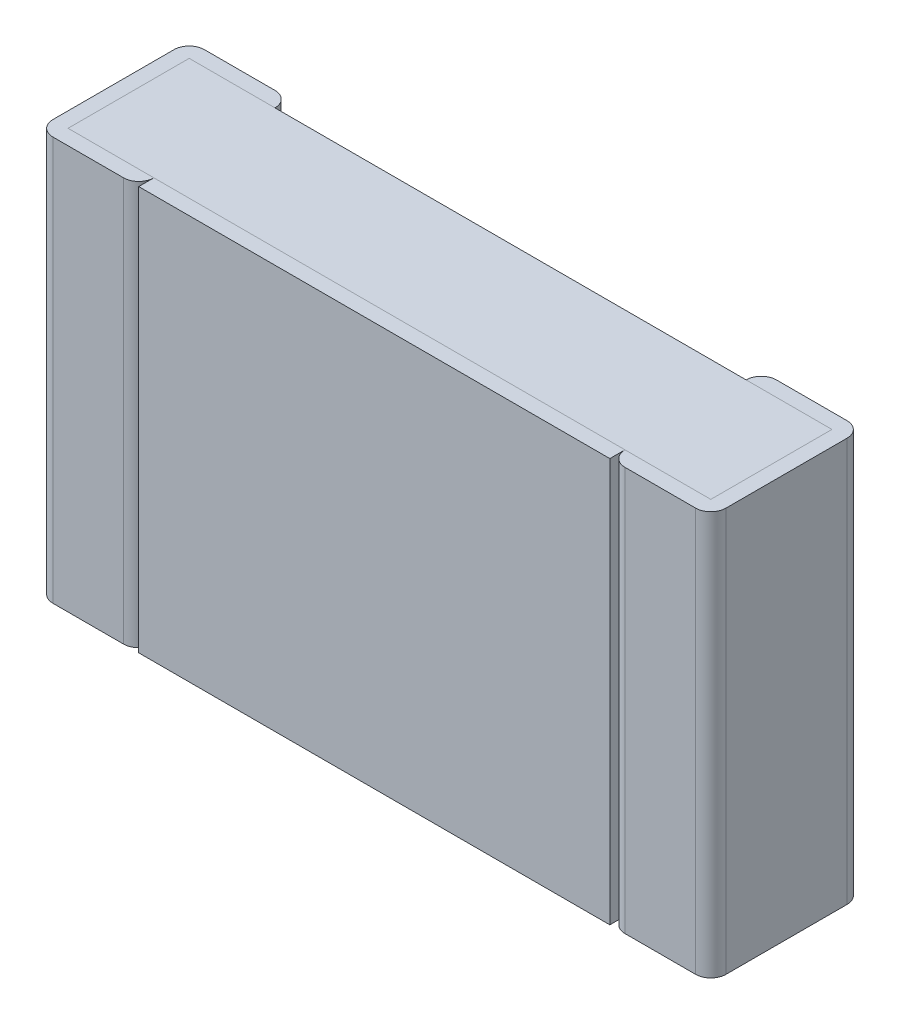
ISO-10303-21;
HEADER;
FILE_DESCRIPTION(('STEP AP214'),'2;1');
FILE_NAME('part.step','',(''),(''),'','','');
FILE_SCHEMA(('AUTOMOTIVE_DESIGN { 1 0 10303 214 1 1 1 1 }'));
ENDSEC;
DATA;
#1=APPLICATION_CONTEXT('core data for automotive mechanical design processes');
#2=APPLICATION_PROTOCOL_DEFINITION('international standard','automotive_design',2000,#1);
#3=PRODUCT_CONTEXT('',#1,'mechanical');
#4=PRODUCT('Part','Part','',(#3));
#5=PRODUCT_RELATED_PRODUCT_CATEGORY('part','',(#4));
#6=PRODUCT_DEFINITION_FORMATION('','',#4);
#7=PRODUCT_DEFINITION_CONTEXT('part definition',#1,'design');
#8=PRODUCT_DEFINITION('design','',#6,#7);
#9=PRODUCT_DEFINITION_SHAPE('','',#8);
#10=(LENGTH_UNIT() NAMED_UNIT(*) SI_UNIT(.MILLI.,.METRE.));
#11=(NAMED_UNIT(*) PLANE_ANGLE_UNIT() SI_UNIT($,.RADIAN.));
#12=(NAMED_UNIT(*) SI_UNIT($,.STERADIAN.) SOLID_ANGLE_UNIT());
#13=UNCERTAINTY_MEASURE_WITH_UNIT(LENGTH_MEASURE(1.E-05),#10,'distance_accuracy_value','');
#14=(GEOMETRIC_REPRESENTATION_CONTEXT(3) GLOBAL_UNCERTAINTY_ASSIGNED_CONTEXT((#13)) GLOBAL_UNIT_ASSIGNED_CONTEXT((#10,
#11,#12)) REPRESENTATION_CONTEXT('',''));
#15=CARTESIAN_POINT('',(0.,0.,0.));
#16=DIRECTION('',(0.,0.,1.));
#17=DIRECTION('',(1.,0.,0.));
#18=AXIS2_PLACEMENT_3D('',#15,#16,#17);
#19=CARTESIAN_POINT('',(-1.,-0.6,0.));
#20=DIRECTION('',(1.,0.,0.));
#21=DIRECTION('',(0.,1.,0.));
#22=AXIS2_PLACEMENT_3D('',#19,#20,#21);
#23=PLANE('',#22);
#24=DIRECTION('',(0.,1.,0.));
#25=VECTOR('',#24,1.);
#26=CARTESIAN_POINT('',(-1.,-0.6,0.405));
#27=LINE('',#26,#25);
#28=CARTESIAN_POINT('',(-1.,-0.6,0.405));
#29=VERTEX_POINT('',#28);
#30=CARTESIAN_POINT('',(-1.,0.6,0.405));
#31=VERTEX_POINT('',#30);
#32=EDGE_CURVE('E11',#29,#31,#27,.T.);
#33=ORIENTED_EDGE('',*,*,#32,.T.);
#34=DIRECTION('',(0.,0.,1.));
#35=VECTOR('',#34,1.);
#36=CARTESIAN_POINT('',(-1.,0.6,0.));
#37=LINE('',#36,#35);
#38=CARTESIAN_POINT('',(-1.,0.6,0.045));
#39=VERTEX_POINT('',#38);
#40=EDGE_CURVE('E41',#39,#31,#37,.T.);
#41=ORIENTED_EDGE('',*,*,#40,.F.);
#42=DIRECTION('',(0.,1.,0.));
#43=VECTOR('',#42,1.);
#44=CARTESIAN_POINT('',(-1.,-0.6,0.045));
#45=LINE('',#44,#43);
#46=CARTESIAN_POINT('',(-1.,-0.6,0.045));
#47=VERTEX_POINT('',#46);
#48=EDGE_CURVE('E215',#47,#39,#45,.T.);
#49=ORIENTED_EDGE('',*,*,#48,.F.);
#50=DIRECTION('',(0.,0.,1.));
#51=VECTOR('',#50,1.);
#52=CARTESIAN_POINT('',(-1.,-0.6,0.));
#53=LINE('',#52,#51);
#54=EDGE_CURVE('E27',#47,#29,#53,.T.);
#55=ORIENTED_EDGE('',*,*,#54,.T.);
#56=EDGE_LOOP('',(#33,#41,#49,#55));
#57=FACE_BOUND('',#56,.T.);
#58=ADVANCED_FACE('F16',(#57),#23,.F.);
#59=CARTESIAN_POINT('',(-1.,-0.6,0.));
#60=DIRECTION('',(0.,1.,0.));
#61=DIRECTION('',(1.,0.,0.));
#62=AXIS2_PLACEMENT_3D('',#59,#60,#61);
#63=PLANE('',#62);
#64=CARTESIAN_POINT('',(-0.745,-0.6,0.045));
#65=DIRECTION('',(0.,1.,0.));
#66=DIRECTION('',(0.,0.,1.));
#67=AXIS2_PLACEMENT_3D('',#64,#65,#66);
#68=CIRCLE('',#67,0.045);
#69=CARTESIAN_POINT('',(-0.7,-0.6,0.045));
#70=VERTEX_POINT('',#69);
#71=CARTESIAN_POINT('',(-0.745,-0.6,0.));
#72=VERTEX_POINT('',#71);
#73=EDGE_CURVE('E285',#70,#72,#68,.T.);
#74=ORIENTED_EDGE('',*,*,#73,.F.);
#75=DIRECTION('',(1.,0.,0.));
#76=VECTOR('',#75,1.);
#77=CARTESIAN_POINT('',(-0.955,-0.6,0.045));
#78=LINE('',#77,#76);
#79=CARTESIAN_POINT('',(-0.955,-0.6,0.045));
#80=VERTEX_POINT('',#79);
#81=EDGE_CURVE('E232',#80,#70,#78,.T.);
#82=ORIENTED_EDGE('',*,*,#81,.F.);
#83=DIRECTION('',(0.,0.,1.));
#84=VECTOR('',#83,1.);
#85=CARTESIAN_POINT('',(-0.955,-0.6,0.045));
#86=LINE('',#85,#84);
#87=CARTESIAN_POINT('',(-0.955,-0.6,0.405));
#88=VERTEX_POINT('',#87);
#89=EDGE_CURVE('E289',#80,#88,#86,.T.);
#90=ORIENTED_EDGE('',*,*,#89,.T.);
#91=DIRECTION('',(1.,0.,0.));
#92=VECTOR('',#91,1.);
#93=CARTESIAN_POINT('',(-0.955,-0.6,0.405));
#94=LINE('',#93,#92);
#95=CARTESIAN_POINT('',(-0.7,-0.6,0.405));
#96=VERTEX_POINT('',#95);
#97=EDGE_CURVE('E292',#88,#96,#94,.T.);
#98=ORIENTED_EDGE('',*,*,#97,.T.);
#99=CARTESIAN_POINT('',(-0.745,-0.6,0.405));
#100=DIRECTION('',(0.,-1.,0.));
#101=DIRECTION('',(0.,0.,1.));
#102=AXIS2_PLACEMENT_3D('',#99,#100,#101);
#103=CIRCLE('',#102,0.045);
#104=CARTESIAN_POINT('',(-0.745,-0.6,0.45));
#105=VERTEX_POINT('',#104);
#106=EDGE_CURVE('E231',#96,#105,#103,.T.);
#107=ORIENTED_EDGE('',*,*,#106,.T.);
#108=DIRECTION('',(1.,0.,0.));
#109=VECTOR('',#108,1.);
#110=CARTESIAN_POINT('',(-1.,-0.6,0.45));
#111=LINE('',#110,#109);
#112=CARTESIAN_POINT('',(-0.955,-0.6,0.45));
#113=VERTEX_POINT('',#112);
#114=EDGE_CURVE('E237',#113,#105,#111,.T.);
#115=ORIENTED_EDGE('',*,*,#114,.F.);
#116=CARTESIAN_POINT('',(-0.955,-0.6,0.405));
#117=DIRECTION('',(0.,1.,0.));
#118=DIRECTION('',(0.,0.,1.));
#119=AXIS2_PLACEMENT_3D('',#116,#117,#118);
#120=CIRCLE('',#119,0.045);
#121=EDGE_CURVE('E216',#29,#113,#120,.T.);
#122=ORIENTED_EDGE('',*,*,#121,.F.);
#123=ORIENTED_EDGE('',*,*,#54,.F.);
#124=CARTESIAN_POINT('',(-0.955,-0.6,0.045));
#125=DIRECTION('',(0.,-1.,0.));
#126=DIRECTION('',(0.,0.,1.));
#127=AXIS2_PLACEMENT_3D('',#124,#125,#126);
#128=CIRCLE('',#127,0.045);
#129=CARTESIAN_POINT('',(-0.955,-0.6,0.));
#130=VERTEX_POINT('',#129);
#131=EDGE_CURVE('E226',#47,#130,#128,.T.);
#132=ORIENTED_EDGE('',*,*,#131,.T.);
#133=DIRECTION('',(1.,0.,0.));
#134=VECTOR('',#133,1.);
#135=CARTESIAN_POINT('',(-1.,-0.6,0.));
#136=LINE('',#135,#134);
#137=EDGE_CURVE('E223',#130,#72,#136,.T.);
#138=ORIENTED_EDGE('',*,*,#137,.T.);
#139=EDGE_LOOP('',(#74,#82,#90,#98,#107,#115,#122,#123,#132,#138));
#140=FACE_BOUND('',#139,.T.);
#141=ADVANCED_FACE('F447',(#140),#63,.F.);
#142=CARTESIAN_POINT('',(-0.955,-0.6,0.045));
#143=DIRECTION('',(0.,1.,0.));
#144=DIRECTION('',(-1.,0.,0.));
#145=AXIS2_PLACEMENT_3D('',#142,#143,#144);
#146=CYLINDRICAL_SURFACE('',#145,0.045);
#147=ORIENTED_EDGE('',*,*,#48,.T.);
#148=CARTESIAN_POINT('',(-0.955,0.6,0.045));
#149=DIRECTION('',(0.,-1.,0.));
#150=DIRECTION('',(0.,0.,1.));
#151=AXIS2_PLACEMENT_3D('',#148,#149,#150);
#152=CIRCLE('',#151,0.045);
#153=CARTESIAN_POINT('',(-0.955,0.6,0.));
#154=VERTEX_POINT('',#153);
#155=EDGE_CURVE('E212',#39,#154,#152,.T.);
#156=ORIENTED_EDGE('',*,*,#155,.T.);
#157=DIRECTION('',(0.,1.,0.));
#158=VECTOR('',#157,1.);
#159=CARTESIAN_POINT('',(-0.955,-0.6,0.));
#160=LINE('',#159,#158);
#161=EDGE_CURVE('E207',#130,#154,#160,.T.);
#162=ORIENTED_EDGE('',*,*,#161,.F.);
#163=ORIENTED_EDGE('',*,*,#131,.F.);
#164=EDGE_LOOP('',(#147,#156,#162,#163));
#165=FACE_BOUND('',#164,.T.);
#166=ADVANCED_FACE('F455',(#165),#146,.T.);
#167=CARTESIAN_POINT('',(-0.955,-0.6,0.405));
#168=DIRECTION('',(0.,1.,0.));
#169=DIRECTION('',(-1.,0.,0.));
#170=AXIS2_PLACEMENT_3D('',#167,#168,#169);
#171=CYLINDRICAL_SURFACE('',#170,0.045);
#172=ORIENTED_EDGE('',*,*,#121,.T.);
#173=DIRECTION('',(0.,1.,0.));
#174=VECTOR('',#173,1.);
#175=CARTESIAN_POINT('',(-0.955,-0.6,0.45));
#176=LINE('',#175,#174);
#177=CARTESIAN_POINT('',(-0.955,0.6,0.45));
#178=VERTEX_POINT('',#177);
#179=EDGE_CURVE('E293',#113,#178,#176,.T.);
#180=ORIENTED_EDGE('',*,*,#179,.T.);
#181=CARTESIAN_POINT('',(-0.955,0.6,0.405));
#182=DIRECTION('',(0.,1.,0.));
#183=DIRECTION('',(0.,0.,1.));
#184=AXIS2_PLACEMENT_3D('',#181,#182,#183);
#185=CIRCLE('',#184,0.045);
#186=EDGE_CURVE('E204',#31,#178,#185,.T.);
#187=ORIENTED_EDGE('',*,*,#186,.F.);
#188=ORIENTED_EDGE('',*,*,#32,.F.);
#189=EDGE_LOOP('',(#172,#180,#187,#188));
#190=FACE_BOUND('',#189,.T.);
#191=ADVANCED_FACE('F525',(#190),#171,.T.);
#192=CARTESIAN_POINT('',(-1.,0.6,0.));
#193=DIRECTION('',(0.,1.,0.));
#194=DIRECTION('',(1.,0.,0.));
#195=AXIS2_PLACEMENT_3D('',#192,#193,#194);
#196=PLANE('',#195);
#197=DIRECTION('',(1.,0.,0.));
#198=VECTOR('',#197,1.);
#199=CARTESIAN_POINT('',(-1.,0.6,0.));
#200=LINE('',#199,#198);
#201=CARTESIAN_POINT('',(-0.745,0.6,0.));
#202=VERTEX_POINT('',#201);
#203=EDGE_CURVE('E317',#154,#202,#200,.T.);
#204=ORIENTED_EDGE('',*,*,#203,.F.);
#205=ORIENTED_EDGE('',*,*,#155,.F.);
#206=ORIENTED_EDGE('',*,*,#40,.T.);
#207=ORIENTED_EDGE('',*,*,#186,.T.);
#208=DIRECTION('',(1.,0.,0.));
#209=VECTOR('',#208,1.);
#210=CARTESIAN_POINT('',(-1.,0.6,0.45));
#211=LINE('',#210,#209);
#212=CARTESIAN_POINT('',(-0.745,0.6,0.45));
#213=VERTEX_POINT('',#212);
#214=EDGE_CURVE('E196',#178,#213,#211,.T.);
#215=ORIENTED_EDGE('',*,*,#214,.T.);
#216=CARTESIAN_POINT('',(-0.745,0.6,0.405));
#217=DIRECTION('',(0.,-1.,0.));
#218=DIRECTION('',(0.,0.,1.));
#219=AXIS2_PLACEMENT_3D('',#216,#217,#218);
#220=CIRCLE('',#219,0.045);
#221=CARTESIAN_POINT('',(-0.7,0.6,0.405));
#222=VERTEX_POINT('',#221);
#223=EDGE_CURVE('E189',#222,#213,#220,.T.);
#224=ORIENTED_EDGE('',*,*,#223,.F.);
#225=DIRECTION('',(1.,0.,0.));
#226=VECTOR('',#225,1.);
#227=CARTESIAN_POINT('',(-0.955,0.6,0.405));
#228=LINE('',#227,#226);
#229=CARTESIAN_POINT('',(-0.955,0.6,0.405));
#230=VERTEX_POINT('',#229);
#231=EDGE_CURVE('E186',#230,#222,#228,.T.);
#232=ORIENTED_EDGE('',*,*,#231,.F.);
#233=DIRECTION('',(0.,0.,1.));
#234=VECTOR('',#233,1.);
#235=CARTESIAN_POINT('',(-0.955,0.6,0.045));
#236=LINE('',#235,#234);
#237=CARTESIAN_POINT('',(-0.955,0.6,0.045));
#238=VERTEX_POINT('',#237);
#239=EDGE_CURVE('E177',#238,#230,#236,.T.);
#240=ORIENTED_EDGE('',*,*,#239,.F.);
#241=DIRECTION('',(1.,0.,0.));
#242=VECTOR('',#241,1.);
#243=CARTESIAN_POINT('',(-0.955,0.6,0.045));
#244=LINE('',#243,#242);
#245=CARTESIAN_POINT('',(-0.7,0.6,0.045));
#246=VERTEX_POINT('',#245);
#247=EDGE_CURVE('E182',#238,#246,#244,.T.);
#248=ORIENTED_EDGE('',*,*,#247,.T.);
#249=CARTESIAN_POINT('',(-0.745,0.6,0.045));
#250=DIRECTION('',(0.,1.,0.));
#251=DIRECTION('',(0.,0.,1.));
#252=AXIS2_PLACEMENT_3D('',#249,#250,#251);
#253=CIRCLE('',#252,0.045);
#254=EDGE_CURVE('E197',#246,#202,#253,.T.);
#255=ORIENTED_EDGE('',*,*,#254,.T.);
#256=EDGE_LOOP('',(#204,#205,#206,#207,#215,#224,#232,#240,#248,#255));
#257=FACE_BOUND('',#256,.T.);
#258=ADVANCED_FACE('F180',(#257),#196,.T.);
#259=CARTESIAN_POINT('',(-1.,-0.6,0.));
#260=DIRECTION('',(0.,0.,1.));
#261=DIRECTION('',(1.,0.,0.));
#262=AXIS2_PLACEMENT_3D('',#259,#260,#261);
#263=PLANE('',#262);
#264=DIRECTION('',(0.,1.,0.));
#265=VECTOR('',#264,1.);
#266=CARTESIAN_POINT('',(-0.745,-0.6,0.));
#267=LINE('',#266,#265);
#268=EDGE_CURVE('E281',#72,#202,#267,.T.);
#269=ORIENTED_EDGE('',*,*,#268,.F.);
#270=ORIENTED_EDGE('',*,*,#137,.F.);
#271=ORIENTED_EDGE('',*,*,#161,.T.);
#272=ORIENTED_EDGE('',*,*,#203,.T.);
#273=EDGE_LOOP('',(#269,#270,#271,#272));
#274=FACE_BOUND('',#273,.T.);
#275=ADVANCED_FACE('F452',(#274),#263,.F.);
#276=CARTESIAN_POINT('',(-0.745,-0.6,0.045));
#277=DIRECTION('',(0.,1.,0.));
#278=DIRECTION('',(1.,0.,0.));
#279=AXIS2_PLACEMENT_3D('',#276,#277,#278);
#280=CYLINDRICAL_SURFACE('',#279,0.045);
#281=ORIENTED_EDGE('',*,*,#73,.T.);
#282=ORIENTED_EDGE('',*,*,#268,.T.);
#283=ORIENTED_EDGE('',*,*,#254,.F.);
#284=DIRECTION('',(0.,1.,0.));
#285=VECTOR('',#284,1.);
#286=CARTESIAN_POINT('',(-0.7,-0.6,0.045));
#287=LINE('',#286,#285);
#288=EDGE_CURVE('E241',#70,#246,#287,.T.);
#289=ORIENTED_EDGE('',*,*,#288,.F.);
#290=EDGE_LOOP('',(#281,#282,#283,#289));
#291=FACE_BOUND('',#290,.T.);
#292=ADVANCED_FACE('F440',(#291),#280,.T.);
#293=CARTESIAN_POINT('',(-0.955,-0.6,0.045));
#294=DIRECTION('',(0.,1.,0.));
#295=DIRECTION('',(1.,0.,0.));
#296=AXIS2_PLACEMENT_3D('',#293,#294,#295);
#297=PLANE('',#296);
#298=DIRECTION('',(1.,0.,0.));
#299=VECTOR('',#298,1.);
#300=CARTESIAN_POINT('',(-0.955,-0.6,0.045));
#301=LINE('',#300,#299);
#302=CARTESIAN_POINT('',(0.7,-0.6,0.045));
#303=VERTEX_POINT('',#302);
#304=EDGE_CURVE('E248',#70,#303,#301,.T.);
#305=ORIENTED_EDGE('',*,*,#304,.T.);
#306=DIRECTION('',(1.,0.,0.));
#307=VECTOR('',#306,1.);
#308=CARTESIAN_POINT('',(-0.955,-0.6,0.045));
#309=LINE('',#308,#307);
#310=CARTESIAN_POINT('',(0.955,-0.6,0.045));
#311=VERTEX_POINT('',#310);
#312=EDGE_CURVE('E245',#303,#311,#309,.T.);
#313=ORIENTED_EDGE('',*,*,#312,.T.);
#314=DIRECTION('',(0.,0.,1.));
#315=VECTOR('',#314,1.);
#316=CARTESIAN_POINT('',(0.955,-0.6,0.045));
#317=LINE('',#316,#315);
#318=CARTESIAN_POINT('',(0.955,-0.6,0.405));
#319=VERTEX_POINT('',#318);
#320=EDGE_CURVE('E236',#311,#319,#317,.T.);
#321=ORIENTED_EDGE('',*,*,#320,.T.);
#322=DIRECTION('',(1.,0.,0.));
#323=VECTOR('',#322,1.);
#324=CARTESIAN_POINT('',(-0.955,-0.6,0.405));
#325=LINE('',#324,#323);
#326=CARTESIAN_POINT('',(0.7,-0.6,0.405));
#327=VERTEX_POINT('',#326);
#328=EDGE_CURVE('E221',#327,#319,#325,.T.);
#329=ORIENTED_EDGE('',*,*,#328,.F.);
#330=DIRECTION('',(1.,0.,0.));
#331=VECTOR('',#330,1.);
#332=CARTESIAN_POINT('',(-0.7,-0.6,0.405));
#333=LINE('',#332,#331);
#334=EDGE_CURVE('E360',#96,#327,#333,.T.);
#335=ORIENTED_EDGE('',*,*,#334,.F.);
#336=ORIENTED_EDGE('',*,*,#97,.F.);
#337=ORIENTED_EDGE('',*,*,#89,.F.);
#338=ORIENTED_EDGE('',*,*,#81,.T.);
#339=EDGE_LOOP('',(#305,#313,#321,#329,#335,#336,#337,#338));
#340=FACE_BOUND('',#339,.T.);
#341=ADVANCED_FACE('F509',(#340),#297,.F.);
#342=CARTESIAN_POINT('',(-1.,-0.6,0.45));
#343=DIRECTION('',(0.,0.,1.));
#344=DIRECTION('',(1.,0.,0.));
#345=AXIS2_PLACEMENT_3D('',#342,#343,#344);
#346=PLANE('',#345);
#347=ORIENTED_EDGE('',*,*,#214,.F.);
#348=ORIENTED_EDGE('',*,*,#179,.F.);
#349=ORIENTED_EDGE('',*,*,#114,.T.);
#350=DIRECTION('',(0.,1.,0.));
#351=VECTOR('',#350,1.);
#352=CARTESIAN_POINT('',(-0.745,-0.6,0.45));
#353=LINE('',#352,#351);
#354=EDGE_CURVE('E280',#105,#213,#353,.T.);
#355=ORIENTED_EDGE('',*,*,#354,.T.);
#356=EDGE_LOOP('',(#347,#348,#349,#355));
#357=FACE_BOUND('',#356,.T.);
#358=ADVANCED_FACE('F528',(#357),#346,.T.);
#359=CARTESIAN_POINT('',(-0.745,-0.6,0.405));
#360=DIRECTION('',(0.,1.,0.));
#361=DIRECTION('',(1.,0.,0.));
#362=AXIS2_PLACEMENT_3D('',#359,#360,#361);
#363=CYLINDRICAL_SURFACE('',#362,0.045);
#364=DIRECTION('',(0.,1.,0.));
#365=VECTOR('',#364,1.);
#366=CARTESIAN_POINT('',(-0.7,-0.6,0.405));
#367=LINE('',#366,#365);
#368=EDGE_CURVE('E299',#96,#222,#367,.T.);
#369=ORIENTED_EDGE('',*,*,#368,.T.);
#370=ORIENTED_EDGE('',*,*,#223,.T.);
#371=ORIENTED_EDGE('',*,*,#354,.F.);
#372=ORIENTED_EDGE('',*,*,#106,.F.);
#373=EDGE_LOOP('',(#369,#370,#371,#372));
#374=FACE_BOUND('',#373,.T.);
#375=ADVANCED_FACE('F519',(#374),#363,.T.);
#376=CARTESIAN_POINT('',(-0.955,0.6,0.045));
#377=DIRECTION('',(0.,1.,0.));
#378=DIRECTION('',(1.,0.,0.));
#379=AXIS2_PLACEMENT_3D('',#376,#377,#378);
#380=PLANE('',#379);
#381=ORIENTED_EDGE('',*,*,#247,.F.);
#382=ORIENTED_EDGE('',*,*,#239,.T.);
#383=ORIENTED_EDGE('',*,*,#231,.T.);
#384=DIRECTION('',(1.,0.,0.));
#385=VECTOR('',#384,1.);
#386=CARTESIAN_POINT('',(-0.7,0.6,0.405));
#387=LINE('',#386,#385);
#388=CARTESIAN_POINT('',(0.7,0.6,0.405));
#389=VERTEX_POINT('',#388);
#390=EDGE_CURVE('E244',#222,#389,#387,.T.);
#391=ORIENTED_EDGE('',*,*,#390,.T.);
#392=DIRECTION('',(1.,0.,0.));
#393=VECTOR('',#392,1.);
#394=CARTESIAN_POINT('',(-0.955,0.6,0.405));
#395=LINE('',#394,#393);
#396=CARTESIAN_POINT('',(0.955,0.6,0.405));
#397=VERTEX_POINT('',#396);
#398=EDGE_CURVE('E240',#389,#397,#395,.T.);
#399=ORIENTED_EDGE('',*,*,#398,.T.);
#400=DIRECTION('',(0.,0.,1.));
#401=VECTOR('',#400,1.);
#402=CARTESIAN_POINT('',(0.955,0.6,0.045));
#403=LINE('',#402,#401);
#404=CARTESIAN_POINT('',(0.955,0.6,0.045));
#405=VERTEX_POINT('',#404);
#406=EDGE_CURVE('E253',#405,#397,#403,.T.);
#407=ORIENTED_EDGE('',*,*,#406,.F.);
#408=DIRECTION('',(1.,0.,0.));
#409=VECTOR('',#408,1.);
#410=CARTESIAN_POINT('',(-0.955,0.6,0.045));
#411=LINE('',#410,#409);
#412=CARTESIAN_POINT('',(0.7,0.6,0.045));
#413=VERTEX_POINT('',#412);
#414=EDGE_CURVE('E262',#413,#405,#411,.T.);
#415=ORIENTED_EDGE('',*,*,#414,.F.);
#416=DIRECTION('',(1.,0.,0.));
#417=VECTOR('',#416,1.);
#418=CARTESIAN_POINT('',(-0.955,0.6,0.045));
#419=LINE('',#418,#417);
#420=EDGE_CURVE('E194',#246,#413,#419,.T.);
#421=ORIENTED_EDGE('',*,*,#420,.F.);
#422=EDGE_LOOP('',(#381,#382,#383,#391,#399,#407,#415,#421));
#423=FACE_BOUND('',#422,.T.);
#424=ADVANCED_FACE('F191',(#423),#380,.T.);
#425=CARTESIAN_POINT('',(-0.955,-0.6,0.045));
#426=DIRECTION('',(0.,0.,1.));
#427=DIRECTION('',(1.,0.,0.));
#428=AXIS2_PLACEMENT_3D('',#425,#426,#427);
#429=PLANE('',#428);
#430=ORIENTED_EDGE('',*,*,#420,.T.);
#431=DIRECTION('',(0.,1.,0.));
#432=VECTOR('',#431,1.);
#433=CARTESIAN_POINT('',(0.7,-0.6,0.045));
#434=LINE('',#433,#432);
#435=EDGE_CURVE('E304',#303,#413,#434,.T.);
#436=ORIENTED_EDGE('',*,*,#435,.F.);
#437=ORIENTED_EDGE('',*,*,#304,.F.);
#438=ORIENTED_EDGE('',*,*,#288,.T.);
#439=EDGE_LOOP('',(#430,#436,#437,#438));
#440=FACE_BOUND('',#439,.T.);
#441=ADVANCED_FACE('F18',(#440),#429,.F.);
#442=CARTESIAN_POINT('',(0.7,-0.6,0.));
#443=DIRECTION('',(0.,1.,0.));
#444=DIRECTION('',(1.,0.,0.));
#445=AXIS2_PLACEMENT_3D('',#442,#443,#444);
#446=PLANE('',#445);
#447=CARTESIAN_POINT('',(0.955,-0.6,0.045));
#448=DIRECTION('',(0.,1.,0.));
#449=DIRECTION('',(0.,0.,1.));
#450=AXIS2_PLACEMENT_3D('',#447,#448,#449);
#451=CIRCLE('',#450,0.045);
#452=CARTESIAN_POINT('',(1.,-0.6,0.045));
#453=VERTEX_POINT('',#452);
#454=CARTESIAN_POINT('',(0.955,-0.6,0.));
#455=VERTEX_POINT('',#454);
#456=EDGE_CURVE('E347',#453,#455,#451,.T.);
#457=ORIENTED_EDGE('',*,*,#456,.F.);
#458=DIRECTION('',(0.,0.,1.));
#459=VECTOR('',#458,1.);
#460=CARTESIAN_POINT('',(1.,-0.6,0.));
#461=LINE('',#460,#459);
#462=CARTESIAN_POINT('',(1.,-0.6,0.405));
#463=VERTEX_POINT('',#462);
#464=EDGE_CURVE('E339',#453,#463,#461,.T.);
#465=ORIENTED_EDGE('',*,*,#464,.T.);
#466=CARTESIAN_POINT('',(0.955,-0.6,0.405));
#467=DIRECTION('',(0.,-1.,0.));
#468=DIRECTION('',(0.,0.,1.));
#469=AXIS2_PLACEMENT_3D('',#466,#467,#468);
#470=CIRCLE('',#469,0.045);
#471=CARTESIAN_POINT('',(0.955,-0.6,0.45));
#472=VERTEX_POINT('',#471);
#473=EDGE_CURVE('E340',#463,#472,#470,.T.);
#474=ORIENTED_EDGE('',*,*,#473,.T.);
#475=DIRECTION('',(1.,0.,0.));
#476=VECTOR('',#475,1.);
#477=CARTESIAN_POINT('',(0.7,-0.6,0.45));
#478=LINE('',#477,#476);
#479=CARTESIAN_POINT('',(0.745,-0.6,0.45));
#480=VERTEX_POINT('',#479);
#481=EDGE_CURVE('E318',#480,#472,#478,.T.);
#482=ORIENTED_EDGE('',*,*,#481,.F.);
#483=CARTESIAN_POINT('',(0.745,-0.6,0.405));
#484=DIRECTION('',(0.,1.,0.));
#485=DIRECTION('',(0.,0.,1.));
#486=AXIS2_PLACEMENT_3D('',#483,#484,#485);
#487=CIRCLE('',#486,0.045);
#488=EDGE_CURVE('E366',#327,#480,#487,.T.);
#489=ORIENTED_EDGE('',*,*,#488,.F.);
#490=ORIENTED_EDGE('',*,*,#328,.T.);
#491=ORIENTED_EDGE('',*,*,#320,.F.);
#492=ORIENTED_EDGE('',*,*,#312,.F.);
#493=CARTESIAN_POINT('',(0.745,-0.6,0.045));
#494=DIRECTION('',(0.,-1.,0.));
#495=DIRECTION('',(0.,0.,1.));
#496=AXIS2_PLACEMENT_3D('',#493,#494,#495);
#497=CIRCLE('',#496,0.045);
#498=CARTESIAN_POINT('',(0.745,-0.6,0.));
#499=VERTEX_POINT('',#498);
#500=EDGE_CURVE('E217',#303,#499,#497,.T.);
#501=ORIENTED_EDGE('',*,*,#500,.T.);
#502=DIRECTION('',(1.,0.,0.));
#503=VECTOR('',#502,1.);
#504=CARTESIAN_POINT('',(0.7,-0.6,0.));
#505=LINE('',#504,#503);
#506=EDGE_CURVE('E222',#499,#455,#505,.T.);
#507=ORIENTED_EDGE('',*,*,#506,.T.);
#508=EDGE_LOOP('',(#457,#465,#474,#482,#489,#490,#491,#492,#501,#507));
#509=FACE_BOUND('',#508,.T.);
#510=ADVANCED_FACE('F506',(#509),#446,.F.);
#511=CARTESIAN_POINT('',(-0.7,-0.6,0.405));
#512=DIRECTION('',(0.,1.,0.));
#513=DIRECTION('',(1.,0.,0.));
#514=AXIS2_PLACEMENT_3D('',#511,#512,#513);
#515=PLANE('',#514);
#516=DIRECTION('',(0.,0.,1.));
#517=VECTOR('',#516,1.);
#518=CARTESIAN_POINT('',(0.7,-0.6,0.405));
#519=LINE('',#518,#517);
#520=CARTESIAN_POINT('',(0.7,-0.6,0.45));
#521=VERTEX_POINT('',#520);
#522=EDGE_CURVE('E329',#327,#521,#519,.T.);
#523=ORIENTED_EDGE('',*,*,#522,.T.);
#524=DIRECTION('',(1.,0.,0.));
#525=VECTOR('',#524,1.);
#526=CARTESIAN_POINT('',(-0.7,-0.6,0.45));
#527=LINE('',#526,#525);
#528=CARTESIAN_POINT('',(-0.7,-0.6,0.45));
#529=VERTEX_POINT('',#528);
#530=EDGE_CURVE('E267',#529,#521,#527,.T.);
#531=ORIENTED_EDGE('',*,*,#530,.F.);
#532=DIRECTION('',(0.,0.,1.));
#533=VECTOR('',#532,1.);
#534=CARTESIAN_POINT('',(-0.7,-0.6,0.405));
#535=LINE('',#534,#533);
#536=EDGE_CURVE('E271',#96,#529,#535,.T.);
#537=ORIENTED_EDGE('',*,*,#536,.F.);
#538=ORIENTED_EDGE('',*,*,#334,.T.);
#539=EDGE_LOOP('',(#523,#531,#537,#538));
#540=FACE_BOUND('',#539,.T.);
#541=ADVANCED_FACE('F408',(#540),#515,.F.);
#542=CARTESIAN_POINT('',(-0.7,-0.6,0.405));
#543=DIRECTION('',(1.,0.,0.));
#544=DIRECTION('',(0.,1.,0.));
#545=AXIS2_PLACEMENT_3D('',#542,#543,#544);
#546=PLANE('',#545);
#547=DIRECTION('',(0.,1.,0.));
#548=VECTOR('',#547,1.);
#549=CARTESIAN_POINT('',(-0.7,-0.6,0.45));
#550=LINE('',#549,#548);
#551=CARTESIAN_POINT('',(-0.7,0.6,0.45));
#552=VERTEX_POINT('',#551);
#553=EDGE_CURVE('E312',#529,#552,#550,.T.);
#554=ORIENTED_EDGE('',*,*,#553,.T.);
#555=DIRECTION('',(0.,0.,1.));
#556=VECTOR('',#555,1.);
#557=CARTESIAN_POINT('',(-0.7,0.6,0.405));
#558=LINE('',#557,#556);
#559=EDGE_CURVE('E255',#222,#552,#558,.T.);
#560=ORIENTED_EDGE('',*,*,#559,.F.);
#561=ORIENTED_EDGE('',*,*,#368,.F.);
#562=ORIENTED_EDGE('',*,*,#536,.T.);
#563=EDGE_LOOP('',(#554,#560,#561,#562));
#564=FACE_BOUND('',#563,.T.);
#565=ADVANCED_FACE('F516',(#564),#546,.F.);
#566=CARTESIAN_POINT('',(0.7,0.6,0.));
#567=DIRECTION('',(0.,1.,0.));
#568=DIRECTION('',(1.,0.,0.));
#569=AXIS2_PLACEMENT_3D('',#566,#567,#568);
#570=PLANE('',#569);
#571=DIRECTION('',(1.,0.,0.));
#572=VECTOR('',#571,1.);
#573=CARTESIAN_POINT('',(0.7,0.6,0.));
#574=LINE('',#573,#572);
#575=CARTESIAN_POINT('',(0.745,0.6,0.));
#576=VERTEX_POINT('',#575);
#577=CARTESIAN_POINT('',(0.955,0.6,0.));
#578=VERTEX_POINT('',#577);
#579=EDGE_CURVE('E336',#576,#578,#574,.T.);
#580=ORIENTED_EDGE('',*,*,#579,.F.);
#581=CARTESIAN_POINT('',(0.745,0.6,0.045));
#582=DIRECTION('',(0.,-1.,0.));
#583=DIRECTION('',(0.,0.,1.));
#584=AXIS2_PLACEMENT_3D('',#581,#582,#583);
#585=CIRCLE('',#584,0.045);
#586=EDGE_CURVE('E300',#413,#576,#585,.T.);
#587=ORIENTED_EDGE('',*,*,#586,.F.);
#588=ORIENTED_EDGE('',*,*,#414,.T.);
#589=ORIENTED_EDGE('',*,*,#406,.T.);
#590=ORIENTED_EDGE('',*,*,#398,.F.);
#591=CARTESIAN_POINT('',(0.745,0.6,0.405));
#592=DIRECTION('',(0.,1.,0.));
#593=DIRECTION('',(0.,0.,1.));
#594=AXIS2_PLACEMENT_3D('',#591,#592,#593);
#595=CIRCLE('',#594,0.045);
#596=CARTESIAN_POINT('',(0.745,0.6,0.45));
#597=VERTEX_POINT('',#596);
#598=EDGE_CURVE('E249',#389,#597,#595,.T.);
#599=ORIENTED_EDGE('',*,*,#598,.T.);
#600=DIRECTION('',(1.,0.,0.));
#601=VECTOR('',#600,1.);
#602=CARTESIAN_POINT('',(0.7,0.6,0.45));
#603=LINE('',#602,#601);
#604=CARTESIAN_POINT('',(0.955,0.6,0.45));
#605=VERTEX_POINT('',#604);
#606=EDGE_CURVE('E254',#597,#605,#603,.T.);
#607=ORIENTED_EDGE('',*,*,#606,.T.);
#608=CARTESIAN_POINT('',(0.955,0.6,0.405));
#609=DIRECTION('',(0.,-1.,0.));
#610=DIRECTION('',(0.,0.,1.));
#611=AXIS2_PLACEMENT_3D('',#608,#609,#610);
#612=CIRCLE('',#611,0.045);
#613=CARTESIAN_POINT('',(1.,0.6,0.405));
#614=VERTEX_POINT('',#613);
#615=EDGE_CURVE('E322',#614,#605,#612,.T.);
#616=ORIENTED_EDGE('',*,*,#615,.F.);
#617=DIRECTION('',(0.,0.,1.));
#618=VECTOR('',#617,1.);
#619=CARTESIAN_POINT('',(1.,0.6,0.));
#620=LINE('',#619,#618);
#621=CARTESIAN_POINT('',(1.,0.6,0.045));
#622=VERTEX_POINT('',#621);
#623=EDGE_CURVE('E380',#622,#614,#620,.T.);
#624=ORIENTED_EDGE('',*,*,#623,.F.);
#625=CARTESIAN_POINT('',(0.955,0.6,0.045));
#626=DIRECTION('',(0.,1.,0.));
#627=DIRECTION('',(0.,0.,1.));
#628=AXIS2_PLACEMENT_3D('',#625,#626,#627);
#629=CIRCLE('',#628,0.045);
#630=EDGE_CURVE('E20',#622,#578,#629,.T.);
#631=ORIENTED_EDGE('',*,*,#630,.T.);
#632=EDGE_LOOP('',(#580,#587,#588,#589,#590,#599,#607,#616,#624,#631));
#633=FACE_BOUND('',#632,.T.);
#634=ADVANCED_FACE('F492',(#633),#570,.T.);
#635=CARTESIAN_POINT('',(-0.7,0.6,0.405));
#636=DIRECTION('',(0.,1.,0.));
#637=DIRECTION('',(1.,0.,0.));
#638=AXIS2_PLACEMENT_3D('',#635,#636,#637);
#639=PLANE('',#638);
#640=ORIENTED_EDGE('',*,*,#390,.F.);
#641=ORIENTED_EDGE('',*,*,#559,.T.);
#642=DIRECTION('',(1.,0.,0.));
#643=VECTOR('',#642,1.);
#644=CARTESIAN_POINT('',(-0.7,0.6,0.45));
#645=LINE('',#644,#643);
#646=CARTESIAN_POINT('',(0.7,0.6,0.45));
#647=VERTEX_POINT('',#646);
#648=EDGE_CURVE('E258',#552,#647,#645,.T.);
#649=ORIENTED_EDGE('',*,*,#648,.T.);
#650=DIRECTION('',(0.,0.,1.));
#651=VECTOR('',#650,1.);
#652=CARTESIAN_POINT('',(0.7,0.6,0.405));
#653=LINE('',#652,#651);
#654=EDGE_CURVE('E277',#389,#647,#653,.T.);
#655=ORIENTED_EDGE('',*,*,#654,.F.);
#656=EDGE_LOOP('',(#640,#641,#649,#655));
#657=FACE_BOUND('',#656,.T.);
#658=ADVANCED_FACE('F572',(#657),#639,.T.);
#659=CARTESIAN_POINT('',(0.745,-0.6,0.045));
#660=DIRECTION('',(0.,1.,0.));
#661=DIRECTION('',(-1.,0.,0.));
#662=AXIS2_PLACEMENT_3D('',#659,#660,#661);
#663=CYLINDRICAL_SURFACE('',#662,0.045);
#664=ORIENTED_EDGE('',*,*,#435,.T.);
#665=ORIENTED_EDGE('',*,*,#586,.T.);
#666=DIRECTION('',(0.,1.,0.));
#667=VECTOR('',#666,1.);
#668=CARTESIAN_POINT('',(0.745,-0.6,0.));
#669=LINE('',#668,#667);
#670=EDGE_CURVE('E305',#499,#576,#669,.T.);
#671=ORIENTED_EDGE('',*,*,#670,.F.);
#672=ORIENTED_EDGE('',*,*,#500,.F.);
#673=EDGE_LOOP('',(#664,#665,#671,#672));
#674=FACE_BOUND('',#673,.T.);
#675=ADVANCED_FACE('F499',(#674),#663,.T.);
#676=CARTESIAN_POINT('',(0.7,-0.6,0.));
#677=DIRECTION('',(0.,0.,1.));
#678=DIRECTION('',(1.,0.,0.));
#679=AXIS2_PLACEMENT_3D('',#676,#677,#678);
#680=PLANE('',#679);
#681=DIRECTION('',(0.,1.,0.));
#682=VECTOR('',#681,1.);
#683=CARTESIAN_POINT('',(0.955,-0.6,0.));
#684=LINE('',#683,#682);
#685=EDGE_CURVE('E372',#455,#578,#684,.T.);
#686=ORIENTED_EDGE('',*,*,#685,.F.);
#687=ORIENTED_EDGE('',*,*,#506,.F.);
#688=ORIENTED_EDGE('',*,*,#670,.T.);
#689=ORIENTED_EDGE('',*,*,#579,.T.);
#690=EDGE_LOOP('',(#686,#687,#688,#689));
#691=FACE_BOUND('',#690,.T.);
#692=ADVANCED_FACE('F504',(#691),#680,.F.);
#693=CARTESIAN_POINT('',(0.955,-0.6,0.045));
#694=DIRECTION('',(0.,1.,0.));
#695=DIRECTION('',(1.,0.,0.));
#696=AXIS2_PLACEMENT_3D('',#693,#694,#695);
#697=CYLINDRICAL_SURFACE('',#696,0.045);
#698=ORIENTED_EDGE('',*,*,#456,.T.);
#699=ORIENTED_EDGE('',*,*,#685,.T.);
#700=ORIENTED_EDGE('',*,*,#630,.F.);
#701=DIRECTION('',(0.,1.,0.));
#702=VECTOR('',#701,1.);
#703=CARTESIAN_POINT('',(1.,-0.6,0.045));
#704=LINE('',#703,#702);
#705=EDGE_CURVE('E376',#453,#622,#704,.T.);
#706=ORIENTED_EDGE('',*,*,#705,.F.);
#707=EDGE_LOOP('',(#698,#699,#700,#706));
#708=FACE_BOUND('',#707,.T.);
#709=ADVANCED_FACE('F553',(#708),#697,.T.);
#710=CARTESIAN_POINT('',(1.,-0.6,0.));
#711=DIRECTION('',(1.,0.,0.));
#712=DIRECTION('',(0.,1.,0.));
#713=AXIS2_PLACEMENT_3D('',#710,#711,#712);
#714=PLANE('',#713);
#715=ORIENTED_EDGE('',*,*,#464,.F.);
#716=ORIENTED_EDGE('',*,*,#705,.T.);
#717=ORIENTED_EDGE('',*,*,#623,.T.);
#718=DIRECTION('',(0.,1.,0.));
#719=VECTOR('',#718,1.);
#720=CARTESIAN_POINT('',(1.,-0.6,0.405));
#721=LINE('',#720,#719);
#722=EDGE_CURVE('E384',#463,#614,#721,.T.);
#723=ORIENTED_EDGE('',*,*,#722,.F.);
#724=EDGE_LOOP('',(#715,#716,#717,#723));
#725=FACE_BOUND('',#724,.T.);
#726=ADVANCED_FACE('F549',(#725),#714,.T.);
#727=CARTESIAN_POINT('',(0.955,-0.6,0.405));
#728=DIRECTION('',(0.,1.,0.));
#729=DIRECTION('',(1.,0.,0.));
#730=AXIS2_PLACEMENT_3D('',#727,#728,#729);
#731=CYLINDRICAL_SURFACE('',#730,0.045);
#732=ORIENTED_EDGE('',*,*,#722,.T.);
#733=ORIENTED_EDGE('',*,*,#615,.T.);
#734=DIRECTION('',(0.,1.,0.));
#735=VECTOR('',#734,1.);
#736=CARTESIAN_POINT('',(0.955,-0.6,0.45));
#737=LINE('',#736,#735);
#738=EDGE_CURVE('E323',#472,#605,#737,.T.);
#739=ORIENTED_EDGE('',*,*,#738,.F.);
#740=ORIENTED_EDGE('',*,*,#473,.F.);
#741=EDGE_LOOP('',(#732,#733,#739,#740));
#742=FACE_BOUND('',#741,.T.);
#743=ADVANCED_FACE('F552',(#742),#731,.T.);
#744=CARTESIAN_POINT('',(0.7,-0.6,0.45));
#745=DIRECTION('',(0.,0.,1.));
#746=DIRECTION('',(1.,0.,0.));
#747=AXIS2_PLACEMENT_3D('',#744,#745,#746);
#748=PLANE('',#747);
#749=ORIENTED_EDGE('',*,*,#606,.F.);
#750=DIRECTION('',(0.,1.,0.));
#751=VECTOR('',#750,1.);
#752=CARTESIAN_POINT('',(0.745,-0.6,0.45));
#753=LINE('',#752,#751);
#754=EDGE_CURVE('E276',#480,#597,#753,.T.);
#755=ORIENTED_EDGE('',*,*,#754,.F.);
#756=ORIENTED_EDGE('',*,*,#481,.T.);
#757=ORIENTED_EDGE('',*,*,#738,.T.);
#758=EDGE_LOOP('',(#749,#755,#756,#757));
#759=FACE_BOUND('',#758,.T.);
#760=ADVANCED_FACE('F558',(#759),#748,.T.);
#761=CARTESIAN_POINT('',(0.745,-0.6,0.405));
#762=DIRECTION('',(0.,1.,0.));
#763=DIRECTION('',(-1.,0.,0.));
#764=AXIS2_PLACEMENT_3D('',#761,#762,#763);
#765=CYLINDRICAL_SURFACE('',#764,0.045);
#766=ORIENTED_EDGE('',*,*,#488,.T.);
#767=ORIENTED_EDGE('',*,*,#754,.T.);
#768=ORIENTED_EDGE('',*,*,#598,.F.);
#769=DIRECTION('',(0.,1.,0.));
#770=VECTOR('',#769,1.);
#771=CARTESIAN_POINT('',(0.7,-0.6,0.405));
#772=LINE('',#771,#770);
#773=EDGE_CURVE('E272',#327,#389,#772,.T.);
#774=ORIENTED_EDGE('',*,*,#773,.F.);
#775=EDGE_LOOP('',(#766,#767,#768,#774));
#776=FACE_BOUND('',#775,.T.);
#777=ADVANCED_FACE('F487',(#776),#765,.T.);
#778=CARTESIAN_POINT('',(0.7,-0.6,0.405));
#779=DIRECTION('',(1.,0.,0.));
#780=DIRECTION('',(0.,1.,0.));
#781=AXIS2_PLACEMENT_3D('',#778,#779,#780);
#782=PLANE('',#781);
#783=ORIENTED_EDGE('',*,*,#522,.F.);
#784=ORIENTED_EDGE('',*,*,#773,.T.);
#785=ORIENTED_EDGE('',*,*,#654,.T.);
#786=DIRECTION('',(0.,1.,0.));
#787=VECTOR('',#786,1.);
#788=CARTESIAN_POINT('',(0.7,-0.6,0.45));
#789=LINE('',#788,#787);
#790=EDGE_CURVE('E263',#521,#647,#789,.T.);
#791=ORIENTED_EDGE('',*,*,#790,.F.);
#792=EDGE_LOOP('',(#783,#784,#785,#791));
#793=FACE_BOUND('',#792,.T.);
#794=ADVANCED_FACE('F414',(#793),#782,.T.);
#795=CARTESIAN_POINT('',(-0.7,-0.6,0.45));
#796=DIRECTION('',(0.,0.,1.));
#797=DIRECTION('',(1.,0.,0.));
#798=AXIS2_PLACEMENT_3D('',#795,#796,#797);
#799=PLANE('',#798);
#800=ORIENTED_EDGE('',*,*,#553,.F.);
#801=ORIENTED_EDGE('',*,*,#530,.T.);
#802=ORIENTED_EDGE('',*,*,#790,.T.);
#803=ORIENTED_EDGE('',*,*,#648,.F.);
#804=EDGE_LOOP('',(#800,#801,#802,#803));
#805=FACE_BOUND('',#804,.T.);
#806=ADVANCED_FACE('F419',(#805),#799,.T.);
#807=CLOSED_SHELL('',(#58,#141,#166,#191,#258,#275,#292,#341,#358,#375,#424,#441,#510,#541,#565,
#634,#658,#675,#692,#709,#726,#743,#760,#777,#794,#806));
#808=MANIFOLD_SOLID_BREP('B1',#807);
#809=ADVANCED_BREP_SHAPE_REPRESENTATION('',(#18,#808),#14);
#810=SHAPE_DEFINITION_REPRESENTATION(#9,#809);
ENDSEC;
END-ISO-10303-21;
